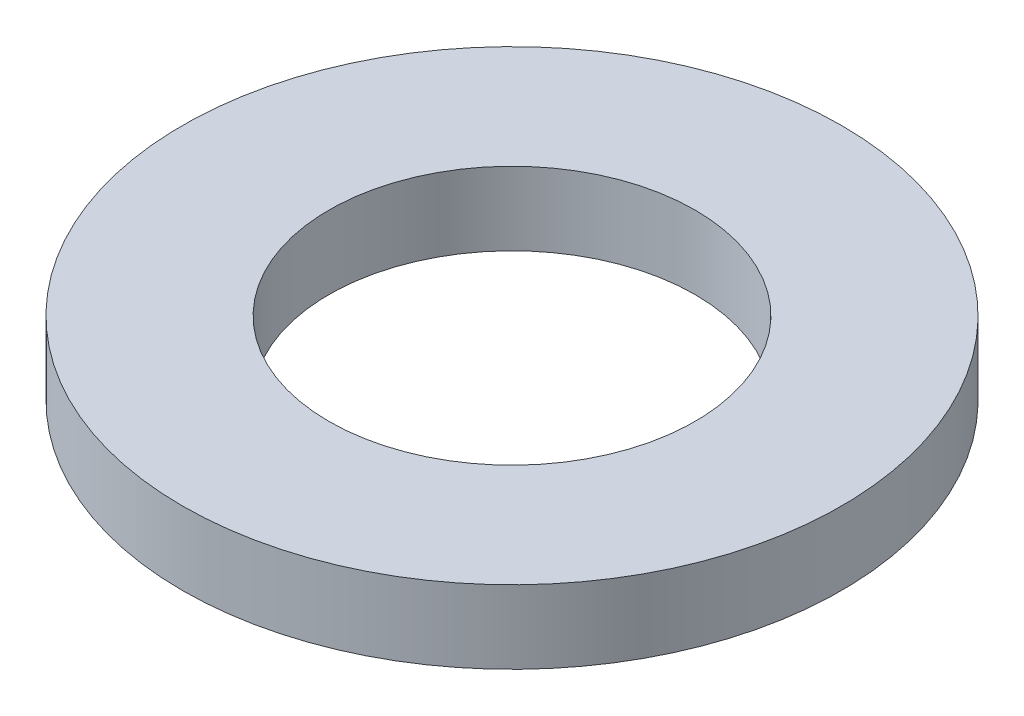
ISO-10303-21;
HEADER;
FILE_DESCRIPTION(('STEP AP214'),'2;1');
FILE_NAME('part.step','',(''),(''),'','','');
FILE_SCHEMA(('AUTOMOTIVE_DESIGN { 1 0 10303 214 1 1 1 1 }'));
ENDSEC;
DATA;
#1=APPLICATION_CONTEXT('core data for automotive mechanical design processes');
#2=APPLICATION_PROTOCOL_DEFINITION('international standard','automotive_design',2000,#1);
#3=PRODUCT_CONTEXT('',#1,'mechanical');
#4=PRODUCT('Part','Part','',(#3));
#5=PRODUCT_RELATED_PRODUCT_CATEGORY('part','',(#4));
#6=PRODUCT_DEFINITION_FORMATION('','',#4);
#7=PRODUCT_DEFINITION_CONTEXT('part definition',#1,'design');
#8=PRODUCT_DEFINITION('design','',#6,#7);
#9=PRODUCT_DEFINITION_SHAPE('','',#8);
#10=(LENGTH_UNIT() NAMED_UNIT(*) SI_UNIT(.MILLI.,.METRE.));
#11=(NAMED_UNIT(*) PLANE_ANGLE_UNIT() SI_UNIT($,.RADIAN.));
#12=(NAMED_UNIT(*) SI_UNIT($,.STERADIAN.) SOLID_ANGLE_UNIT());
#13=UNCERTAINTY_MEASURE_WITH_UNIT(LENGTH_MEASURE(1.E-05),#10,'distance_accuracy_value','');
#14=(GEOMETRIC_REPRESENTATION_CONTEXT(3) GLOBAL_UNCERTAINTY_ASSIGNED_CONTEXT((#13)) GLOBAL_UNIT_ASSIGNED_CONTEXT((#10,
#11,#12)) REPRESENTATION_CONTEXT('',''));
#15=CARTESIAN_POINT('',(0.,0.,0.));
#16=DIRECTION('',(0.,0.,1.));
#17=DIRECTION('',(1.,0.,0.));
#18=AXIS2_PLACEMENT_3D('',#15,#16,#17);
#19=CARTESIAN_POINT('',(0.,10.,0.));
#20=DIRECTION('',(0.,1.,0.));
#21=DIRECTION('',(0.,0.,1.));
#22=AXIS2_PLACEMENT_3D('',#19,#20,#21);
#23=PLANE('',#22);
#24=CARTESIAN_POINT('',(0.,10.,0.));
#25=DIRECTION('',(0.,1.,0.));
#26=DIRECTION('',(0.,0.,1.));
#27=AXIS2_PLACEMENT_3D('',#24,#25,#26);
#28=CIRCLE('',#27,45.);
#29=CARTESIAN_POINT('',(0.,10.,45.));
#30=VERTEX_POINT('',#29);
#31=EDGE_CURVE('E10',#30,#30,#28,.T.);
#32=ORIENTED_EDGE('',*,*,#31,.T.);
#33=EDGE_LOOP('',(#32));
#34=FACE_BOUND('',#33,.T.);
#35=CARTESIAN_POINT('',(0.,10.,0.));
#36=DIRECTION('',(0.,1.,0.));
#37=DIRECTION('',(0.,0.,1.));
#38=AXIS2_PLACEMENT_3D('',#35,#36,#37);
#39=CIRCLE('',#38,25.);
#40=CARTESIAN_POINT('',(0.,10.,25.));
#41=VERTEX_POINT('',#40);
#42=EDGE_CURVE('E42',#41,#41,#39,.T.);
#43=ORIENTED_EDGE('',*,*,#42,.F.);
#44=EDGE_LOOP('',(#43));
#45=FACE_BOUND('',#44,.T.);
#46=ADVANCED_FACE('F31',(#34,#45),#23,.T.);
#47=CARTESIAN_POINT('',(0.,0.,0.));
#48=DIRECTION('',(0.,1.,0.));
#49=DIRECTION('',(0.,0.,1.));
#50=AXIS2_PLACEMENT_3D('',#47,#48,#49);
#51=PLANE('',#50);
#52=CARTESIAN_POINT('',(0.,0.,0.));
#53=DIRECTION('',(0.,1.,0.));
#54=DIRECTION('',(0.,0.,1.));
#55=AXIS2_PLACEMENT_3D('',#52,#53,#54);
#56=CIRCLE('',#55,45.);
#57=CARTESIAN_POINT('',(0.,0.,45.));
#58=VERTEX_POINT('',#57);
#59=EDGE_CURVE('E35',#58,#58,#56,.T.);
#60=ORIENTED_EDGE('',*,*,#59,.F.);
#61=EDGE_LOOP('',(#60));
#62=FACE_BOUND('',#61,.T.);
#63=CARTESIAN_POINT('',(0.,0.,0.));
#64=DIRECTION('',(0.,1.,0.));
#65=DIRECTION('',(0.,0.,1.));
#66=AXIS2_PLACEMENT_3D('',#63,#64,#65);
#67=CIRCLE('',#66,25.);
#68=CARTESIAN_POINT('',(0.,0.,25.));
#69=VERTEX_POINT('',#68);
#70=EDGE_CURVE('E44',#69,#69,#67,.T.);
#71=ORIENTED_EDGE('',*,*,#70,.T.);
#72=EDGE_LOOP('',(#71));
#73=FACE_BOUND('',#72,.T.);
#74=ADVANCED_FACE('F54',(#62,#73),#51,.F.);
#75=CARTESIAN_POINT('',(0.,10.,0.));
#76=DIRECTION('',(0.,-1.,0.));
#77=DIRECTION('',(0.,0.,-1.));
#78=AXIS2_PLACEMENT_3D('',#75,#76,#77);
#79=CYLINDRICAL_SURFACE('',#78,45.);
#80=ORIENTED_EDGE('',*,*,#31,.F.);
#81=EDGE_LOOP('',(#80));
#82=FACE_BOUND('',#81,.T.);
#83=ORIENTED_EDGE('',*,*,#59,.T.);
#84=EDGE_LOOP('',(#83));
#85=FACE_BOUND('',#84,.T.);
#86=ADVANCED_FACE('F33',(#82,#85),#79,.T.);
#87=CARTESIAN_POINT('',(0.,10.,0.));
#88=DIRECTION('',(0.,-1.,0.));
#89=DIRECTION('',(0.,0.,-1.));
#90=AXIS2_PLACEMENT_3D('',#87,#88,#89);
#91=CYLINDRICAL_SURFACE('',#90,25.);
#92=ORIENTED_EDGE('',*,*,#42,.T.);
#93=EDGE_LOOP('',(#92));
#94=FACE_BOUND('',#93,.T.);
#95=ORIENTED_EDGE('',*,*,#70,.F.);
#96=EDGE_LOOP('',(#95));
#97=FACE_BOUND('',#96,.T.);
#98=ADVANCED_FACE('F50',(#94,#97),#91,.F.);
#99=CLOSED_SHELL('',(#46,#74,#86,#98));
#100=MANIFOLD_SOLID_BREP('B2',#99);
#101=ADVANCED_BREP_SHAPE_REPRESENTATION('',(#18,#100),#14);
#102=SHAPE_DEFINITION_REPRESENTATION(#9,#101);
ENDSEC;
END-ISO-10303-21;
